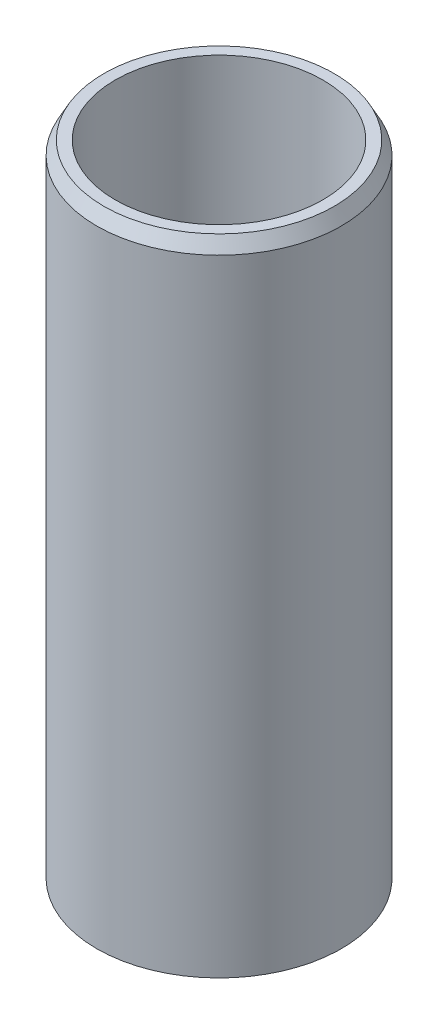
ISO-10303-21;
HEADER;
FILE_DESCRIPTION(('STEP AP214'),'2;1');
FILE_NAME('part.step','',(''),(''),'','','');
FILE_SCHEMA(('AUTOMOTIVE_DESIGN { 1 0 10303 214 1 1 1 1 }'));
ENDSEC;
DATA;
#1=APPLICATION_CONTEXT('core data for automotive mechanical design processes');
#2=APPLICATION_PROTOCOL_DEFINITION('international standard','automotive_design',2000,#1);
#3=PRODUCT_CONTEXT('',#1,'mechanical');
#4=PRODUCT('Part','Part','',(#3));
#5=PRODUCT_RELATED_PRODUCT_CATEGORY('part','',(#4));
#6=PRODUCT_DEFINITION_FORMATION('','',#4);
#7=PRODUCT_DEFINITION_CONTEXT('part definition',#1,'design');
#8=PRODUCT_DEFINITION('design','',#6,#7);
#9=PRODUCT_DEFINITION_SHAPE('','',#8);
#10=(LENGTH_UNIT() NAMED_UNIT(*) SI_UNIT(.MILLI.,.METRE.));
#11=(NAMED_UNIT(*) PLANE_ANGLE_UNIT() SI_UNIT($,.RADIAN.));
#12=(NAMED_UNIT(*) SI_UNIT($,.STERADIAN.) SOLID_ANGLE_UNIT());
#13=UNCERTAINTY_MEASURE_WITH_UNIT(LENGTH_MEASURE(1.E-05),#10,'distance_accuracy_value','');
#14=(GEOMETRIC_REPRESENTATION_CONTEXT(3) GLOBAL_UNCERTAINTY_ASSIGNED_CONTEXT((#13)) GLOBAL_UNIT_ASSIGNED_CONTEXT((#10,
#11,#12)) REPRESENTATION_CONTEXT('',''));
#15=CARTESIAN_POINT('',(0.,0.,0.));
#16=DIRECTION('',(0.,0.,1.));
#17=DIRECTION('',(1.,0.,0.));
#18=AXIS2_PLACEMENT_3D('',#15,#16,#17);
#19=CARTESIAN_POINT('',(0.,264.278653374535,0.));
#20=DIRECTION('',(0.,-1.,0.));
#21=DIRECTION('',(0.,0.,-1.));
#22=AXIS2_PLACEMENT_3D('',#19,#20,#21);
#23=CYLINDRICAL_SURFACE('',#22,50.);
#24=CARTESIAN_POINT('',(0.,258.800948318351,0.));
#25=DIRECTION('',(0.,1.,0.));
#26=DIRECTION('',(0.,0.,1.));
#27=AXIS2_PLACEMENT_3D('',#24,#25,#26);
#28=CIRCLE('',#27,50.);
#29=CARTESIAN_POINT('',(0.,258.800948318351,50.));
#30=VERTEX_POINT('',#29);
#31=EDGE_CURVE('E50',#30,#30,#28,.F.);
#32=ORIENTED_EDGE('',*,*,#31,.T.);
#33=EDGE_LOOP('',(#32));
#34=FACE_BOUND('',#33,.T.);
#35=CARTESIAN_POINT('',(0.,2.94835272660349,0.));
#36=DIRECTION('',(0.,1.,0.));
#37=DIRECTION('',(0.,0.,1.));
#38=AXIS2_PLACEMENT_3D('',#35,#36,#37);
#39=CIRCLE('',#38,50.);
#40=CARTESIAN_POINT('',(0.,2.94835272660349,50.));
#41=VERTEX_POINT('',#40);
#42=EDGE_CURVE('E51',#41,#41,#39,.T.);
#43=ORIENTED_EDGE('',*,*,#42,.T.);
#44=EDGE_LOOP('',(#43));
#45=FACE_BOUND('',#44,.T.);
#46=ADVANCED_FACE('F39',(#34,#45),#23,.T.);
#47=CARTESIAN_POINT('',(0.,264.278653374535,0.));
#48=DIRECTION('',(0.,1.,0.));
#49=DIRECTION('',(0.,0.,1.));
#50=AXIS2_PLACEMENT_3D('',#47,#48,#49);
#51=PLANE('',#50);
#52=CARTESIAN_POINT('',(0.,264.278653374535,0.));
#53=DIRECTION('',(0.,1.,0.));
#54=DIRECTION('',(0.,0.,1.));
#55=AXIS2_PLACEMENT_3D('',#52,#53,#54);
#56=CIRCLE('',#55,47.0516472733966);
#57=CARTESIAN_POINT('',(0.,264.278653374535,47.0516472733966));
#58=VERTEX_POINT('',#57);
#59=EDGE_CURVE('E54',#58,#58,#56,.T.);
#60=ORIENTED_EDGE('',*,*,#59,.T.);
#61=EDGE_LOOP('',(#60));
#62=FACE_BOUND('',#61,.T.);
#63=CARTESIAN_POINT('',(0.,264.278653374535,0.));
#64=DIRECTION('',(0.,1.,0.));
#65=DIRECTION('',(0.,0.,1.));
#66=AXIS2_PLACEMENT_3D('',#63,#64,#65);
#67=CIRCLE('',#66,42.4553930070152);
#68=CARTESIAN_POINT('',(0.,264.278653374535,42.4553930070152));
#69=VERTEX_POINT('',#68);
#70=EDGE_CURVE('E58',#69,#69,#67,.T.);
#71=ORIENTED_EDGE('',*,*,#70,.F.);
#72=EDGE_LOOP('',(#71));
#73=FACE_BOUND('',#72,.T.);
#74=ADVANCED_FACE('F69',(#62,#73),#51,.T.);
#75=CARTESIAN_POINT('',(0.,0.,0.));
#76=DIRECTION('',(0.,1.,0.));
#77=DIRECTION('',(0.,0.,1.));
#78=AXIS2_PLACEMENT_3D('',#75,#76,#77);
#79=PLANE('',#78);
#80=CARTESIAN_POINT('',(0.,0.,0.));
#81=DIRECTION('',(0.,1.,0.));
#82=DIRECTION('',(0.,0.,1.));
#83=AXIS2_PLACEMENT_3D('',#80,#81,#82);
#84=CIRCLE('',#83,44.5222949438156);
#85=CARTESIAN_POINT('',(0.,0.,44.5222949438156));
#86=VERTEX_POINT('',#85);
#87=EDGE_CURVE('E10',#86,#86,#84,.F.);
#88=ORIENTED_EDGE('',*,*,#87,.T.);
#89=EDGE_LOOP('',(#88));
#90=FACE_BOUND('',#89,.T.);
#91=CARTESIAN_POINT('',(0.,0.,0.));
#92=DIRECTION('',(0.,1.,0.));
#93=DIRECTION('',(0.,0.,1.));
#94=AXIS2_PLACEMENT_3D('',#91,#92,#93);
#95=CIRCLE('',#94,42.4553930070152);
#96=CARTESIAN_POINT('',(0.,0.,42.4553930070152));
#97=VERTEX_POINT('',#96);
#98=EDGE_CURVE('E63',#97,#97,#95,.T.);
#99=ORIENTED_EDGE('',*,*,#98,.T.);
#100=EDGE_LOOP('',(#99));
#101=FACE_BOUND('',#100,.T.);
#102=ADVANCED_FACE('F75',(#90,#101),#79,.F.);
#103=CARTESIAN_POINT('',(0.,264.278653374535,0.));
#104=DIRECTION('',(0.,-1.,0.));
#105=DIRECTION('',(0.,0.,-1.));
#106=AXIS2_PLACEMENT_3D('',#103,#104,#105);
#107=CYLINDRICAL_SURFACE('',#106,42.4553930070152);
#108=ORIENTED_EDGE('',*,*,#70,.T.);
#109=EDGE_LOOP('',(#108));
#110=FACE_BOUND('',#109,.T.);
#111=ORIENTED_EDGE('',*,*,#98,.F.);
#112=EDGE_LOOP('',(#111));
#113=FACE_BOUND('',#112,.T.);
#114=ADVANCED_FACE('F70',(#110,#113),#107,.F.);
#115=CARTESIAN_POINT('',(0.,264.278653374535,0.));
#116=DIRECTION('',(0.,-1.,0.));
#117=DIRECTION('',(0.,0.,-1.));
#118=AXIS2_PLACEMENT_3D('',#115,#116,#117);
#119=CONICAL_SURFACE('',#118,47.0516472733966,0.493774246704506);
#120=ORIENTED_EDGE('',*,*,#31,.F.);
#121=EDGE_LOOP('',(#120));
#122=FACE_BOUND('',#121,.T.);
#123=ORIENTED_EDGE('',*,*,#59,.F.);
#124=EDGE_LOOP('',(#123));
#125=FACE_BOUND('',#124,.T.);
#126=ADVANCED_FACE('F81',(#122,#125),#119,.T.);
#127=CARTESIAN_POINT('',(0.,2.94835272660349,0.));
#128=DIRECTION('',(0.,1.,0.));
#129=DIRECTION('',(0.,0.,1.));
#130=AXIS2_PLACEMENT_3D('',#127,#128,#129);
#131=CONICAL_SURFACE('',#130,50.,1.07702208009039);
#132=ORIENTED_EDGE('',*,*,#87,.F.);
#133=EDGE_LOOP('',(#132));
#134=FACE_BOUND('',#133,.T.);
#135=ORIENTED_EDGE('',*,*,#42,.F.);
#136=EDGE_LOOP('',(#135));
#137=FACE_BOUND('',#136,.T.);
#138=ADVANCED_FACE('F45',(#134,#137),#131,.T.);
#139=CLOSED_SHELL('',(#46,#74,#102,#114,#126,#138));
#140=MANIFOLD_SOLID_BREP('B2',#139);
#141=ADVANCED_BREP_SHAPE_REPRESENTATION('',(#18,#140),#14);
#142=SHAPE_DEFINITION_REPRESENTATION(#9,#141);
ENDSEC;
END-ISO-10303-21;
